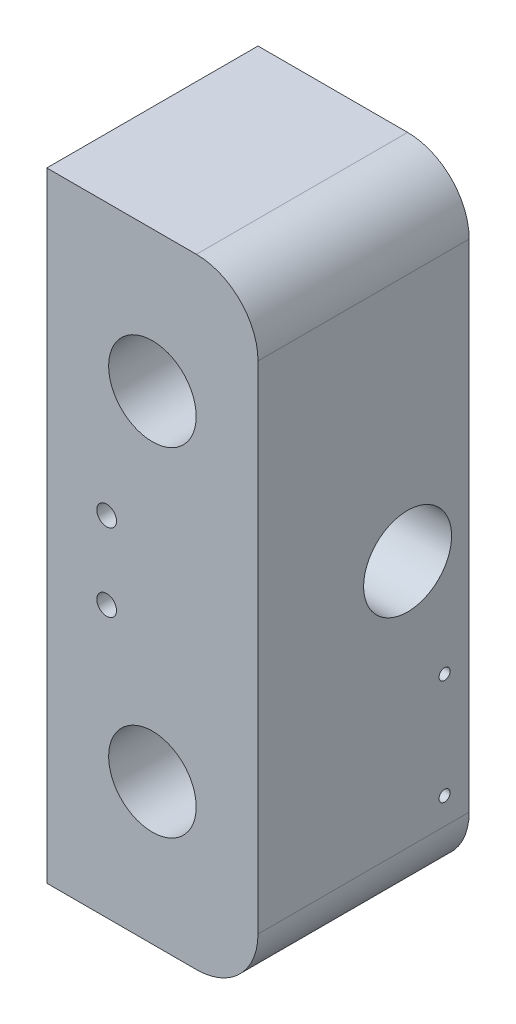
ISO-10303-21;
HEADER;
FILE_DESCRIPTION(('STEP AP214'),'2;1');
FILE_NAME('part.step','',(''),(''),'','','');
FILE_SCHEMA(('AUTOMOTIVE_DESIGN { 1 0 10303 214 1 1 1 1 }'));
ENDSEC;
DATA;
#1=APPLICATION_CONTEXT('core data for automotive mechanical design processes');
#2=APPLICATION_PROTOCOL_DEFINITION('international standard','automotive_design',2000,#1);
#3=PRODUCT_CONTEXT('',#1,'mechanical');
#4=PRODUCT('Part','Part','',(#3));
#5=PRODUCT_RELATED_PRODUCT_CATEGORY('part','',(#4));
#6=PRODUCT_DEFINITION_FORMATION('','',#4);
#7=PRODUCT_DEFINITION_CONTEXT('part definition',#1,'design');
#8=PRODUCT_DEFINITION('design','',#6,#7);
#9=PRODUCT_DEFINITION_SHAPE('','',#8);
#10=(LENGTH_UNIT() NAMED_UNIT(*) SI_UNIT(.MILLI.,.METRE.));
#11=(NAMED_UNIT(*) PLANE_ANGLE_UNIT() SI_UNIT($,.RADIAN.));
#12=(NAMED_UNIT(*) SI_UNIT($,.STERADIAN.) SOLID_ANGLE_UNIT());
#13=UNCERTAINTY_MEASURE_WITH_UNIT(LENGTH_MEASURE(1.E-05),#10,'distance_accuracy_value','');
#14=(GEOMETRIC_REPRESENTATION_CONTEXT(3) GLOBAL_UNCERTAINTY_ASSIGNED_CONTEXT((#13)) GLOBAL_UNIT_ASSIGNED_CONTEXT((#10,
#11,#12)) REPRESENTATION_CONTEXT('',''));
#15=CARTESIAN_POINT('',(0.,0.,0.));
#16=DIRECTION('',(0.,0.,1.));
#17=DIRECTION('',(1.,0.,0.));
#18=AXIS2_PLACEMENT_3D('',#15,#16,#17);
#19=CARTESIAN_POINT('',(-19.05,111.76,19.05));
#20=DIRECTION('',(0.,0.,-1.));
#21=DIRECTION('',(-1.,0.,0.));
#22=AXIS2_PLACEMENT_3D('',#19,#20,#21);
#23=PLANE('',#22);
#24=CARTESIAN_POINT('',(7.93750000000001,11.1125,19.05));
#25=DIRECTION('',(0.,0.,-1.));
#26=DIRECTION('',(-1.,0.,0.));
#27=AXIS2_PLACEMENT_3D('',#24,#25,#26);
#28=CIRCLE('',#27,11.1125);
#29=CARTESIAN_POINT('',(19.05,11.1125,19.05));
#30=VERTEX_POINT('',#29);
#31=CARTESIAN_POINT('',(7.93750000000001,0.,19.05));
#32=VERTEX_POINT('',#31);
#33=EDGE_CURVE('E213',#30,#32,#28,.T.);
#34=ORIENTED_EDGE('',*,*,#33,.F.);
#35=DIRECTION('',(0.,-1.,0.));
#36=VECTOR('',#35,1.);
#37=CARTESIAN_POINT('',(19.05,111.76,19.05));
#38=LINE('',#37,#36);
#39=CARTESIAN_POINT('',(19.05,100.6475,19.05));
#40=VERTEX_POINT('',#39);
#41=EDGE_CURVE('E177',#40,#30,#38,.T.);
#42=ORIENTED_EDGE('',*,*,#41,.F.);
#43=CARTESIAN_POINT('',(7.93750000000001,100.6475,19.05));
#44=DIRECTION('',(0.,0.,-1.));
#45=DIRECTION('',(-1.,0.,0.));
#46=AXIS2_PLACEMENT_3D('',#43,#44,#45);
#47=CIRCLE('',#46,11.1125);
#48=CARTESIAN_POINT('',(7.93750000000001,111.76,19.05));
#49=VERTEX_POINT('',#48);
#50=EDGE_CURVE('E217',#40,#49,#47,.F.);
#51=ORIENTED_EDGE('',*,*,#50,.T.);
#52=DIRECTION('',(1.,0.,0.));
#53=VECTOR('',#52,1.);
#54=CARTESIAN_POINT('',(-19.05,111.76,19.05));
#55=LINE('',#54,#53);
#56=CARTESIAN_POINT('',(-19.05,111.76,19.05));
#57=VERTEX_POINT('',#56);
#58=EDGE_CURVE('E174',#57,#49,#55,.T.);
#59=ORIENTED_EDGE('',*,*,#58,.F.);
#60=DIRECTION('',(0.,-1.,0.));
#61=VECTOR('',#60,1.);
#62=CARTESIAN_POINT('',(-19.05,111.76,19.05));
#63=LINE('',#62,#61);
#64=CARTESIAN_POINT('',(-19.05,0.,19.05));
#65=VERTEX_POINT('',#64);
#66=EDGE_CURVE('E187',#57,#65,#63,.T.);
#67=ORIENTED_EDGE('',*,*,#66,.T.);
#68=DIRECTION('',(1.,0.,0.));
#69=VECTOR('',#68,1.);
#70=CARTESIAN_POINT('',(-19.05,0.,19.05));
#71=LINE('',#70,#69);
#72=EDGE_CURVE('E172',#65,#32,#71,.T.);
#73=ORIENTED_EDGE('',*,*,#72,.T.);
#74=EDGE_LOOP('',(#34,#42,#51,#59,#67,#73));
#75=FACE_BOUND('',#74,.T.);
#76=CARTESIAN_POINT('',(-8.25500000000001,48.895,19.05));
#77=DIRECTION('',(0.,0.,-1.));
#78=DIRECTION('',(-1.,0.,0.));
#79=AXIS2_PLACEMENT_3D('',#76,#77,#78);
#80=CIRCLE('',#79,1.778);
#81=CARTESIAN_POINT('',(-10.033,48.895,19.05));
#82=VERTEX_POINT('',#81);
#83=EDGE_CURVE('E206',#82,#82,#80,.T.);
#84=ORIENTED_EDGE('',*,*,#83,.T.);
#85=EDGE_LOOP('',(#84));
#86=FACE_BOUND('',#85,.T.);
#87=CARTESIAN_POINT('',(0.,86.4,19.05));
#88=DIRECTION('',(0.,0.,-1.));
#89=DIRECTION('',(-1.,0.,0.));
#90=AXIS2_PLACEMENT_3D('',#87,#88,#89);
#91=CIRCLE('',#90,7.89999994799999);
#92=CARTESIAN_POINT('',(-7.899999948,86.4,19.05));
#93=VERTEX_POINT('',#92);
#94=EDGE_CURVE('E181',#93,#93,#91,.T.);
#95=ORIENTED_EDGE('',*,*,#94,.T.);
#96=EDGE_LOOP('',(#95));
#97=FACE_BOUND('',#96,.T.);
#98=CARTESIAN_POINT('',(0.,25.4,19.05));
#99=DIRECTION('',(0.,0.,-1.));
#100=DIRECTION('',(-1.,0.,0.));
#101=AXIS2_PLACEMENT_3D('',#98,#99,#100);
#102=CIRCLE('',#101,7.89999994800001);
#103=CARTESIAN_POINT('',(-7.89999994800001,25.4,19.05));
#104=VERTEX_POINT('',#103);
#105=EDGE_CURVE('E166',#104,#104,#102,.T.);
#106=ORIENTED_EDGE('',*,*,#105,.T.);
#107=EDGE_LOOP('',(#106));
#108=FACE_BOUND('',#107,.T.);
#109=CARTESIAN_POINT('',(-8.25500000000001,62.865,19.05));
#110=DIRECTION('',(0.,0.,-1.));
#111=DIRECTION('',(-1.,0.,0.));
#112=AXIS2_PLACEMENT_3D('',#109,#110,#111);
#113=CIRCLE('',#112,1.778);
#114=CARTESIAN_POINT('',(-10.033,62.865,19.05));
#115=VERTEX_POINT('',#114);
#116=EDGE_CURVE('E204',#115,#115,#113,.F.);
#117=ORIENTED_EDGE('',*,*,#116,.F.);
#118=EDGE_LOOP('',(#117));
#119=FACE_BOUND('',#118,.T.);
#120=ADVANCED_FACE('F34',(#75,#86,#97,#108,#119),#23,.F.);
#121=CARTESIAN_POINT('',(-19.05,111.76,-19.05));
#122=DIRECTION('',(0.,0.,1.));
#123=DIRECTION('',(1.,0.,0.));
#124=AXIS2_PLACEMENT_3D('',#121,#122,#123);
#125=PLANE('',#124);
#126=CARTESIAN_POINT('',(7.93750000000001,11.1125,-19.05));
#127=DIRECTION('',(0.,0.,-1.));
#128=DIRECTION('',(-1.,0.,0.));
#129=AXIS2_PLACEMENT_3D('',#126,#127,#128);
#130=CIRCLE('',#129,11.1125);
#131=CARTESIAN_POINT('',(19.05,11.1125,-19.05));
#132=VERTEX_POINT('',#131);
#133=CARTESIAN_POINT('',(7.93750000000001,0.,-19.05));
#134=VERTEX_POINT('',#133);
#135=EDGE_CURVE('E38',#132,#134,#130,.T.);
#136=ORIENTED_EDGE('',*,*,#135,.T.);
#137=DIRECTION('',(-1.,0.,0.));
#138=VECTOR('',#137,1.);
#139=CARTESIAN_POINT('',(-19.05,0.,-19.05));
#140=LINE('',#139,#138);
#141=CARTESIAN_POINT('',(-19.05,0.,-19.05));
#142=VERTEX_POINT('',#141);
#143=EDGE_CURVE('E178',#134,#142,#140,.T.);
#144=ORIENTED_EDGE('',*,*,#143,.T.);
#145=DIRECTION('',(0.,-1.,0.));
#146=VECTOR('',#145,1.);
#147=CARTESIAN_POINT('',(-19.05,111.76,-19.05));
#148=LINE('',#147,#146);
#149=CARTESIAN_POINT('',(-19.05,44.45,-19.05));
#150=VERTEX_POINT('',#149);
#151=EDGE_CURVE('E190',#150,#142,#148,.T.);
#152=ORIENTED_EDGE('',*,*,#151,.F.);
#153=DIRECTION('',(-1.,0.,0.));
#154=VECTOR('',#153,1.);
#155=CARTESIAN_POINT('',(-19.05,44.45,-19.05));
#156=LINE('',#155,#154);
#157=CARTESIAN_POINT('',(1.26999999999999,44.45,-19.05));
#158=VERTEX_POINT('',#157);
#159=EDGE_CURVE('E134',#158,#150,#156,.T.);
#160=ORIENTED_EDGE('',*,*,#159,.F.);
#161=DIRECTION('',(0.,-1.,0.));
#162=VECTOR('',#161,1.);
#163=CARTESIAN_POINT('',(1.26999999999999,44.45,-19.05));
#164=LINE('',#163,#162);
#165=CARTESIAN_POINT('',(1.26999999999999,67.31,-19.05));
#166=VERTEX_POINT('',#165);
#167=EDGE_CURVE('E146',#166,#158,#164,.T.);
#168=ORIENTED_EDGE('',*,*,#167,.F.);
#169=DIRECTION('',(1.,0.,0.));
#170=VECTOR('',#169,1.);
#171=CARTESIAN_POINT('',(-19.05,67.31,-19.05));
#172=LINE('',#171,#170);
#173=CARTESIAN_POINT('',(-19.05,67.31,-19.05));
#174=VERTEX_POINT('',#173);
#175=EDGE_CURVE('E153',#174,#166,#172,.T.);
#176=ORIENTED_EDGE('',*,*,#175,.F.);
#177=CARTESIAN_POINT('',(-19.05,111.76,-19.05));
#178=VERTEX_POINT('',#177);
#179=EDGE_CURVE('E44',#178,#174,#148,.T.);
#180=ORIENTED_EDGE('',*,*,#179,.F.);
#181=DIRECTION('',(-1.,0.,0.));
#182=VECTOR('',#181,1.);
#183=CARTESIAN_POINT('',(-19.05,111.76,-19.05));
#184=LINE('',#183,#182);
#185=CARTESIAN_POINT('',(7.93750000000001,111.76,-19.05));
#186=VERTEX_POINT('',#185);
#187=EDGE_CURVE('E169',#186,#178,#184,.T.);
#188=ORIENTED_EDGE('',*,*,#187,.F.);
#189=CARTESIAN_POINT('',(7.93750000000001,100.6475,-19.05));
#190=DIRECTION('',(0.,0.,-1.));
#191=DIRECTION('',(-1.,0.,0.));
#192=AXIS2_PLACEMENT_3D('',#189,#190,#191);
#193=CIRCLE('',#192,11.1125);
#194=CARTESIAN_POINT('',(19.05,100.6475,-19.05));
#195=VERTEX_POINT('',#194);
#196=EDGE_CURVE('E53',#195,#186,#193,.F.);
#197=ORIENTED_EDGE('',*,*,#196,.F.);
#198=DIRECTION('',(0.,-1.,0.));
#199=VECTOR('',#198,1.);
#200=CARTESIAN_POINT('',(19.05,111.76,-19.05));
#201=LINE('',#200,#199);
#202=EDGE_CURVE('E11',#195,#132,#201,.T.);
#203=ORIENTED_EDGE('',*,*,#202,.T.);
#204=EDGE_LOOP('',(#136,#144,#152,#160,#168,#176,#180,#188,#197,#203));
#205=FACE_BOUND('',#204,.T.);
#206=CARTESIAN_POINT('',(0.,86.4,-19.05));
#207=DIRECTION('',(0.,0.,1.));
#208=DIRECTION('',(1.,0.,0.));
#209=AXIS2_PLACEMENT_3D('',#206,#207,#208);
#210=CIRCLE('',#209,7.89999994799999);
#211=CARTESIAN_POINT('',(7.89999994799999,86.4,-19.05));
#212=VERTEX_POINT('',#211);
#213=EDGE_CURVE('E163',#212,#212,#210,.T.);
#214=ORIENTED_EDGE('',*,*,#213,.T.);
#215=EDGE_LOOP('',(#214));
#216=FACE_BOUND('',#215,.T.);
#217=CARTESIAN_POINT('',(0.,25.4,-19.05));
#218=DIRECTION('',(0.,0.,1.));
#219=DIRECTION('',(1.,0.,0.));
#220=AXIS2_PLACEMENT_3D('',#217,#218,#219);
#221=CIRCLE('',#220,7.89999994800001);
#222=CARTESIAN_POINT('',(7.89999994800001,25.4,-19.05));
#223=VERTEX_POINT('',#222);
#224=EDGE_CURVE('E138',#223,#223,#221,.T.);
#225=ORIENTED_EDGE('',*,*,#224,.T.);
#226=EDGE_LOOP('',(#225));
#227=FACE_BOUND('',#226,.T.);
#228=ADVANCED_FACE('F262',(#205,#216,#227),#125,.F.);
#229=CARTESIAN_POINT('',(0.,111.76,0.));
#230=DIRECTION('',(0.,-1.,0.));
#231=DIRECTION('',(0.,0.,-1.));
#232=AXIS2_PLACEMENT_3D('',#229,#230,#231);
#233=PLANE('',#232);
#234=DIRECTION('',(0.,0.,-1.));
#235=VECTOR('',#234,1.);
#236=CARTESIAN_POINT('',(7.93750000000001,111.76,19.05));
#237=LINE('',#236,#235);
#238=EDGE_CURVE('E76',#49,#186,#237,.T.);
#239=ORIENTED_EDGE('',*,*,#238,.T.);
#240=ORIENTED_EDGE('',*,*,#187,.T.);
#241=DIRECTION('',(0.,0.,1.));
#242=VECTOR('',#241,1.);
#243=CARTESIAN_POINT('',(-19.05,111.76,19.05));
#244=LINE('',#243,#242);
#245=EDGE_CURVE('E171',#178,#57,#244,.T.);
#246=ORIENTED_EDGE('',*,*,#245,.T.);
#247=ORIENTED_EDGE('',*,*,#58,.T.);
#248=EDGE_LOOP('',(#239,#240,#246,#247));
#249=FACE_BOUND('',#248,.T.);
#250=ADVANCED_FACE('F268',(#249),#233,.F.);
#251=CARTESIAN_POINT('',(0.,0.,3.17499999999999));
#252=DIRECTION('',(0.,0.,1.));
#253=DIRECTION('',(1.,0.,0.));
#254=AXIS2_PLACEMENT_3D('',#251,#252,#253);
#255=PLANE('',#254);
#256=CARTESIAN_POINT('',(-8.25500000000001,48.895,3.17499999999999));
#257=DIRECTION('',(0.,0.,1.));
#258=DIRECTION('',(1.,0.,0.));
#259=AXIS2_PLACEMENT_3D('',#256,#257,#258);
#260=CIRCLE('',#259,1.778);
#261=CARTESIAN_POINT('',(-6.47700000000001,48.895,3.17499999999999));
#262=VERTEX_POINT('',#261);
#263=EDGE_CURVE('E200',#262,#262,#260,.T.);
#264=ORIENTED_EDGE('',*,*,#263,.T.);
#265=EDGE_LOOP('',(#264));
#266=FACE_BOUND('',#265,.T.);
#267=DIRECTION('',(0.,1.,0.));
#268=VECTOR('',#267,1.);
#269=CARTESIAN_POINT('',(-19.05,67.31,3.17499999999999));
#270=LINE('',#269,#268);
#271=CARTESIAN_POINT('',(-19.05,44.45,3.17499999999999));
#272=VERTEX_POINT('',#271);
#273=CARTESIAN_POINT('',(-19.05,67.31,3.17499999999999));
#274=VERTEX_POINT('',#273);
#275=EDGE_CURVE('E123',#272,#274,#270,.T.);
#276=ORIENTED_EDGE('',*,*,#275,.T.);
#277=DIRECTION('',(1.,0.,0.));
#278=VECTOR('',#277,1.);
#279=CARTESIAN_POINT('',(-19.05,67.31,3.17499999999999));
#280=LINE('',#279,#278);
#281=CARTESIAN_POINT('',(1.26999999999999,67.31,3.17499999999999));
#282=VERTEX_POINT('',#281);
#283=EDGE_CURVE('E143',#274,#282,#280,.T.);
#284=ORIENTED_EDGE('',*,*,#283,.T.);
#285=DIRECTION('',(0.,-1.,0.));
#286=VECTOR('',#285,1.);
#287=CARTESIAN_POINT('',(1.26999999999999,44.45,3.17499999999999));
#288=LINE('',#287,#286);
#289=CARTESIAN_POINT('',(1.26999999999999,44.45,3.17499999999999));
#290=VERTEX_POINT('',#289);
#291=EDGE_CURVE('E126',#282,#290,#288,.T.);
#292=ORIENTED_EDGE('',*,*,#291,.T.);
#293=DIRECTION('',(-1.,0.,0.));
#294=VECTOR('',#293,1.);
#295=CARTESIAN_POINT('',(-19.05,44.45,3.17499999999999));
#296=LINE('',#295,#294);
#297=EDGE_CURVE('E117',#290,#272,#296,.T.);
#298=ORIENTED_EDGE('',*,*,#297,.T.);
#299=EDGE_LOOP('',(#276,#284,#292,#298));
#300=FACE_BOUND('',#299,.T.);
#301=CARTESIAN_POINT('',(-8.25500000000001,62.865,3.17499999999999));
#302=DIRECTION('',(0.,0.,1.));
#303=DIRECTION('',(1.,0.,0.));
#304=AXIS2_PLACEMENT_3D('',#301,#302,#303);
#305=CIRCLE('',#304,1.778);
#306=CARTESIAN_POINT('',(-6.47700000000001,62.865,3.17499999999999));
#307=VERTEX_POINT('',#306);
#308=EDGE_CURVE('E203',#307,#307,#305,.F.);
#309=ORIENTED_EDGE('',*,*,#308,.F.);
#310=EDGE_LOOP('',(#309));
#311=FACE_BOUND('',#310,.T.);
#312=ADVANCED_FACE('F119',(#266,#300,#311),#255,.F.);
#313=CARTESIAN_POINT('',(19.05,111.76,19.05));
#314=DIRECTION('',(-1.,0.,0.));
#315=DIRECTION('',(0.,0.,1.));
#316=AXIS2_PLACEMENT_3D('',#313,#314,#315);
#317=PLANE('',#316);
#318=CARTESIAN_POINT('',(19.05,55.88,-7.93750000000001));
#319=DIRECTION('',(-1.,0.,0.));
#320=DIRECTION('',(0.,0.,1.));
#321=AXIS2_PLACEMENT_3D('',#318,#319,#320);
#322=CIRCLE('',#321,7.9375);
#323=CARTESIAN_POINT('',(19.05,55.88,0.));
#324=VERTEX_POINT('',#323);
#325=EDGE_CURVE('E199',#324,#324,#322,.T.);
#326=ORIENTED_EDGE('',*,*,#325,.T.);
#327=EDGE_LOOP('',(#326));
#328=FACE_BOUND('',#327,.T.);
#329=CARTESIAN_POINT('',(19.05,15.9,-14.605));
#330=DIRECTION('',(1.,0.,0.));
#331=DIRECTION('',(0.,0.,-1.));
#332=AXIS2_PLACEMENT_3D('',#329,#330,#331);
#333=CIRCLE('',#332,1.);
#334=CARTESIAN_POINT('',(19.05,15.9,-15.605));
#335=VERTEX_POINT('',#334);
#336=EDGE_CURVE('E149',#335,#335,#333,.T.);
#337=ORIENTED_EDGE('',*,*,#336,.F.);
#338=EDGE_LOOP('',(#337));
#339=FACE_BOUND('',#338,.T.);
#340=ORIENTED_EDGE('',*,*,#41,.T.);
#341=DIRECTION('',(0.,0.,-1.));
#342=VECTOR('',#341,1.);
#343=CARTESIAN_POINT('',(19.05,11.1125,19.05));
#344=LINE('',#343,#342);
#345=EDGE_CURVE('E211',#30,#132,#344,.T.);
#346=ORIENTED_EDGE('',*,*,#345,.T.);
#347=ORIENTED_EDGE('',*,*,#202,.F.);
#348=DIRECTION('',(0.,0.,-1.));
#349=VECTOR('',#348,1.);
#350=CARTESIAN_POINT('',(19.05,100.6475,19.05));
#351=LINE('',#350,#349);
#352=EDGE_CURVE('E219',#40,#195,#351,.T.);
#353=ORIENTED_EDGE('',*,*,#352,.F.);
#354=EDGE_LOOP('',(#340,#346,#347,#353));
#355=FACE_BOUND('',#354,.T.);
#356=CARTESIAN_POINT('',(19.05,34.9,-14.605));
#357=DIRECTION('',(1.,0.,0.));
#358=DIRECTION('',(0.,0.,-1.));
#359=AXIS2_PLACEMENT_3D('',#356,#357,#358);
#360=CIRCLE('',#359,1.);
#361=CARTESIAN_POINT('',(19.05,34.9,-15.605));
#362=VERTEX_POINT('',#361);
#363=EDGE_CURVE('E228',#362,#362,#360,.F.);
#364=ORIENTED_EDGE('',*,*,#363,.T.);
#365=EDGE_LOOP('',(#364));
#366=FACE_BOUND('',#365,.T.);
#367=ADVANCED_FACE('F36',(#328,#339,#355,#366),#317,.F.);
#368=CARTESIAN_POINT('',(-19.05,111.76,19.05));
#369=DIRECTION('',(1.,0.,0.));
#370=DIRECTION('',(0.,0.,-1.));
#371=AXIS2_PLACEMENT_3D('',#368,#369,#370);
#372=PLANE('',#371);
#373=ORIENTED_EDGE('',*,*,#275,.F.);
#374=DIRECTION('',(0.,0.,-1.));
#375=VECTOR('',#374,1.);
#376=CARTESIAN_POINT('',(-19.05,44.45,3.17499999999999));
#377=LINE('',#376,#375);
#378=EDGE_CURVE('E131',#272,#150,#377,.T.);
#379=ORIENTED_EDGE('',*,*,#378,.T.);
#380=ORIENTED_EDGE('',*,*,#151,.T.);
#381=DIRECTION('',(0.,0.,1.));
#382=VECTOR('',#381,1.);
#383=CARTESIAN_POINT('',(-19.05,0.,19.05));
#384=LINE('',#383,#382);
#385=EDGE_CURVE('E180',#142,#65,#384,.T.);
#386=ORIENTED_EDGE('',*,*,#385,.T.);
#387=ORIENTED_EDGE('',*,*,#66,.F.);
#388=ORIENTED_EDGE('',*,*,#245,.F.);
#389=ORIENTED_EDGE('',*,*,#179,.T.);
#390=DIRECTION('',(0.,0.,-1.));
#391=VECTOR('',#390,1.);
#392=CARTESIAN_POINT('',(-19.05,67.31,3.17499999999999));
#393=LINE('',#392,#391);
#394=EDGE_CURVE('E128',#274,#174,#393,.T.);
#395=ORIENTED_EDGE('',*,*,#394,.F.);
#396=EDGE_LOOP('',(#373,#379,#380,#386,#387,#388,#389,#395));
#397=FACE_BOUND('',#396,.T.);
#398=ADVANCED_FACE('F141',(#397),#372,.F.);
#399=CARTESIAN_POINT('',(0.,0.,0.));
#400=DIRECTION('',(0.,-1.,0.));
#401=DIRECTION('',(0.,0.,-1.));
#402=AXIS2_PLACEMENT_3D('',#399,#400,#401);
#403=PLANE('',#402);
#404=DIRECTION('',(0.,0.,-1.));
#405=VECTOR('',#404,1.);
#406=CARTESIAN_POINT('',(7.93750000000001,0.,19.05));
#407=LINE('',#406,#405);
#408=EDGE_CURVE('E72',#32,#134,#407,.T.);
#409=ORIENTED_EDGE('',*,*,#408,.F.);
#410=ORIENTED_EDGE('',*,*,#72,.F.);
#411=ORIENTED_EDGE('',*,*,#385,.F.);
#412=ORIENTED_EDGE('',*,*,#143,.F.);
#413=EDGE_LOOP('',(#409,#410,#411,#412));
#414=FACE_BOUND('',#413,.T.);
#415=ADVANCED_FACE('F273',(#414),#403,.T.);
#416=CARTESIAN_POINT('',(0.,25.4,-19.05));
#417=DIRECTION('',(0.,0.,1.));
#418=DIRECTION('',(1.,0.,0.));
#419=AXIS2_PLACEMENT_3D('',#416,#417,#418);
#420=CYLINDRICAL_SURFACE('',#419,7.89999994800001);
#421=ORIENTED_EDGE('',*,*,#224,.F.);
#422=EDGE_LOOP('',(#421));
#423=FACE_BOUND('',#422,.T.);
#424=ORIENTED_EDGE('',*,*,#105,.F.);
#425=EDGE_LOOP('',(#424));
#426=FACE_BOUND('',#425,.T.);
#427=ADVANCED_FACE('F279',(#423,#426),#420,.F.);
#428=CARTESIAN_POINT('',(0.,86.4,-19.05));
#429=DIRECTION('',(0.,0.,1.));
#430=DIRECTION('',(1.,0.,0.));
#431=AXIS2_PLACEMENT_3D('',#428,#429,#430);
#432=CYLINDRICAL_SURFACE('',#431,7.89999994799999);
#433=ORIENTED_EDGE('',*,*,#213,.F.);
#434=EDGE_LOOP('',(#433));
#435=FACE_BOUND('',#434,.T.);
#436=ORIENTED_EDGE('',*,*,#94,.F.);
#437=EDGE_LOOP('',(#436));
#438=FACE_BOUND('',#437,.T.);
#439=ADVANCED_FACE('F284',(#435,#438),#432,.F.);
#440=CARTESIAN_POINT('',(-19.05,44.45,3.17499999999999));
#441=DIRECTION('',(0.,-1.,0.));
#442=DIRECTION('',(0.,0.,-1.));
#443=AXIS2_PLACEMENT_3D('',#440,#441,#442);
#444=PLANE('',#443);
#445=ORIENTED_EDGE('',*,*,#159,.T.);
#446=ORIENTED_EDGE('',*,*,#378,.F.);
#447=ORIENTED_EDGE('',*,*,#297,.F.);
#448=DIRECTION('',(0.,0.,-1.));
#449=VECTOR('',#448,1.);
#450=CARTESIAN_POINT('',(1.26999999999999,44.45,3.17499999999999));
#451=LINE('',#450,#449);
#452=EDGE_CURVE('E139',#290,#158,#451,.T.);
#453=ORIENTED_EDGE('',*,*,#452,.T.);
#454=EDGE_LOOP('',(#445,#446,#447,#453));
#455=FACE_BOUND('',#454,.T.);
#456=ADVANCED_FACE('F132',(#455),#444,.F.);
#457=CARTESIAN_POINT('',(1.26999999999999,44.45,3.17499999999999));
#458=DIRECTION('',(1.,0.,0.));
#459=DIRECTION('',(0.,0.,-1.));
#460=AXIS2_PLACEMENT_3D('',#457,#458,#459);
#461=PLANE('',#460);
#462=CARTESIAN_POINT('',(1.26999999999999,55.88,-7.93750000000001));
#463=DIRECTION('',(1.,0.,0.));
#464=DIRECTION('',(0.,0.,-1.));
#465=AXIS2_PLACEMENT_3D('',#462,#463,#464);
#466=CIRCLE('',#465,7.9375);
#467=CARTESIAN_POINT('',(1.26999999999999,55.88,-15.875));
#468=VERTEX_POINT('',#467);
#469=EDGE_CURVE('E196',#468,#468,#466,.T.);
#470=ORIENTED_EDGE('',*,*,#469,.T.);
#471=EDGE_LOOP('',(#470));
#472=FACE_BOUND('',#471,.T.);
#473=ORIENTED_EDGE('',*,*,#167,.T.);
#474=ORIENTED_EDGE('',*,*,#452,.F.);
#475=ORIENTED_EDGE('',*,*,#291,.F.);
#476=DIRECTION('',(0.,0.,-1.));
#477=VECTOR('',#476,1.);
#478=CARTESIAN_POINT('',(1.26999999999999,67.31,3.17499999999999));
#479=LINE('',#478,#477);
#480=EDGE_CURVE('E160',#282,#166,#479,.T.);
#481=ORIENTED_EDGE('',*,*,#480,.T.);
#482=EDGE_LOOP('',(#473,#474,#475,#481));
#483=FACE_BOUND('',#482,.T.);
#484=ADVANCED_FACE('F297',(#472,#483),#461,.F.);
#485=CARTESIAN_POINT('',(-19.05,67.31,3.17499999999999));
#486=DIRECTION('',(0.,1.,0.));
#487=DIRECTION('',(0.,0.,1.));
#488=AXIS2_PLACEMENT_3D('',#485,#486,#487);
#489=PLANE('',#488);
#490=ORIENTED_EDGE('',*,*,#175,.T.);
#491=ORIENTED_EDGE('',*,*,#480,.F.);
#492=ORIENTED_EDGE('',*,*,#283,.F.);
#493=ORIENTED_EDGE('',*,*,#394,.T.);
#494=EDGE_LOOP('',(#490,#491,#492,#493));
#495=FACE_BOUND('',#494,.T.);
#496=ADVANCED_FACE('F299',(#495),#489,.F.);
#497=CARTESIAN_POINT('',(13.335,15.9,-14.605));
#498=DIRECTION('',(1.,0.,0.));
#499=DIRECTION('',(0.,0.,-1.));
#500=AXIS2_PLACEMENT_3D('',#497,#498,#499);
#501=CYLINDRICAL_SURFACE('',#500,1.);
#502=CARTESIAN_POINT('',(13.335,15.9,-14.605));
#503=DIRECTION('',(1.,0.,0.));
#504=DIRECTION('',(0.,0.,-1.));
#505=AXIS2_PLACEMENT_3D('',#502,#503,#504);
#506=CIRCLE('',#505,1.);
#507=CARTESIAN_POINT('',(13.335,15.9,-15.605));
#508=VERTEX_POINT('',#507);
#509=EDGE_CURVE('E230',#508,#508,#506,.T.);
#510=ORIENTED_EDGE('',*,*,#509,.F.);
#511=EDGE_LOOP('',(#510));
#512=FACE_BOUND('',#511,.T.);
#513=ORIENTED_EDGE('',*,*,#336,.T.);
#514=EDGE_LOOP('',(#513));
#515=FACE_BOUND('',#514,.T.);
#516=ADVANCED_FACE('F237',(#512,#515),#501,.F.);
#517=CARTESIAN_POINT('',(13.335,0.,0.));
#518=DIRECTION('',(1.,0.,0.));
#519=DIRECTION('',(0.,0.,-1.));
#520=AXIS2_PLACEMENT_3D('',#517,#518,#519);
#521=PLANE('',#520);
#522=ORIENTED_EDGE('',*,*,#509,.T.);
#523=EDGE_LOOP('',(#522));
#524=FACE_BOUND('',#523,.T.);
#525=ADVANCED_FACE('F250',(#524),#521,.T.);
#526=CARTESIAN_POINT('',(13.335,34.9,-14.605));
#527=DIRECTION('',(1.,0.,0.));
#528=DIRECTION('',(0.,0.,-1.));
#529=AXIS2_PLACEMENT_3D('',#526,#527,#528);
#530=CYLINDRICAL_SURFACE('',#529,1.);
#531=CARTESIAN_POINT('',(13.335,34.9,-14.605));
#532=DIRECTION('',(1.,0.,0.));
#533=DIRECTION('',(0.,0.,-1.));
#534=AXIS2_PLACEMENT_3D('',#531,#532,#533);
#535=CIRCLE('',#534,1.);
#536=CARTESIAN_POINT('',(13.335,34.9,-15.605));
#537=VERTEX_POINT('',#536);
#538=EDGE_CURVE('E156',#537,#537,#535,.F.);
#539=ORIENTED_EDGE('',*,*,#538,.T.);
#540=EDGE_LOOP('',(#539));
#541=FACE_BOUND('',#540,.T.);
#542=ORIENTED_EDGE('',*,*,#363,.F.);
#543=EDGE_LOOP('',(#542));
#544=FACE_BOUND('',#543,.T.);
#545=ADVANCED_FACE('F247',(#541,#544),#530,.F.);
#546=CARTESIAN_POINT('',(13.335,0.,0.));
#547=DIRECTION('',(1.,0.,0.));
#548=DIRECTION('',(0.,0.,-1.));
#549=AXIS2_PLACEMENT_3D('',#546,#547,#548);
#550=PLANE('',#549);
#551=ORIENTED_EDGE('',*,*,#538,.F.);
#552=EDGE_LOOP('',(#551));
#553=FACE_BOUND('',#552,.T.);
#554=ADVANCED_FACE('F249',(#553),#550,.T.);
#555=CARTESIAN_POINT('',(19.05,55.88,-7.93750000000001));
#556=DIRECTION('',(-1.,0.,0.));
#557=DIRECTION('',(0.,0.,1.));
#558=AXIS2_PLACEMENT_3D('',#555,#556,#557);
#559=CYLINDRICAL_SURFACE('',#558,7.9375);
#560=ORIENTED_EDGE('',*,*,#325,.F.);
#561=EDGE_LOOP('',(#560));
#562=FACE_BOUND('',#561,.T.);
#563=ORIENTED_EDGE('',*,*,#469,.F.);
#564=EDGE_LOOP('',(#563));
#565=FACE_BOUND('',#564,.T.);
#566=ADVANCED_FACE('F257',(#562,#565),#559,.F.);
#567=CARTESIAN_POINT('',(-8.25500000000001,48.895,19.05));
#568=DIRECTION('',(0.,0.,-1.));
#569=DIRECTION('',(-1.,0.,0.));
#570=AXIS2_PLACEMENT_3D('',#567,#568,#569);
#571=CYLINDRICAL_SURFACE('',#570,1.778);
#572=ORIENTED_EDGE('',*,*,#83,.F.);
#573=EDGE_LOOP('',(#572));
#574=FACE_BOUND('',#573,.T.);
#575=ORIENTED_EDGE('',*,*,#263,.F.);
#576=EDGE_LOOP('',(#575));
#577=FACE_BOUND('',#576,.T.);
#578=ADVANCED_FACE('F333',(#574,#577),#571,.F.);
#579=CARTESIAN_POINT('',(-8.25500000000001,62.865,19.05));
#580=DIRECTION('',(0.,0.,-1.));
#581=DIRECTION('',(-1.,0.,0.));
#582=AXIS2_PLACEMENT_3D('',#579,#580,#581);
#583=CYLINDRICAL_SURFACE('',#582,1.778);
#584=ORIENTED_EDGE('',*,*,#116,.T.);
#585=EDGE_LOOP('',(#584));
#586=FACE_BOUND('',#585,.T.);
#587=ORIENTED_EDGE('',*,*,#308,.T.);
#588=EDGE_LOOP('',(#587));
#589=FACE_BOUND('',#588,.T.);
#590=ADVANCED_FACE('F326',(#586,#589),#583,.F.);
#591=CARTESIAN_POINT('',(7.93750000000001,11.1125,19.05));
#592=DIRECTION('',(0.,0.,-1.));
#593=DIRECTION('',(-1.,0.,0.));
#594=AXIS2_PLACEMENT_3D('',#591,#592,#593);
#595=CYLINDRICAL_SURFACE('',#594,11.1125);
#596=ORIENTED_EDGE('',*,*,#135,.F.);
#597=ORIENTED_EDGE('',*,*,#345,.F.);
#598=ORIENTED_EDGE('',*,*,#33,.T.);
#599=ORIENTED_EDGE('',*,*,#408,.T.);
#600=EDGE_LOOP('',(#596,#597,#598,#599));
#601=FACE_BOUND('',#600,.T.);
#602=ADVANCED_FACE('F323',(#601),#595,.T.);
#603=CARTESIAN_POINT('',(7.93750000000001,100.6475,19.05));
#604=DIRECTION('',(0.,0.,-1.));
#605=DIRECTION('',(-1.,0.,0.));
#606=AXIS2_PLACEMENT_3D('',#603,#604,#605);
#607=CYLINDRICAL_SURFACE('',#606,11.1125);
#608=ORIENTED_EDGE('',*,*,#238,.F.);
#609=ORIENTED_EDGE('',*,*,#50,.F.);
#610=ORIENTED_EDGE('',*,*,#352,.T.);
#611=ORIENTED_EDGE('',*,*,#196,.T.);
#612=EDGE_LOOP('',(#608,#609,#610,#611));
#613=FACE_BOUND('',#612,.T.);
#614=ADVANCED_FACE('F325',(#613),#607,.T.);
#615=CLOSED_SHELL('',(#120,#228,#250,#312,#367,#398,#415,#427,#439,#456,#484,#496,#516,#525,
#545,#554,#566,#578,#590,#602,#614));
#616=MANIFOLD_SOLID_BREP('B2',#615);
#617=ADVANCED_BREP_SHAPE_REPRESENTATION('',(#18,#616),#14);
#618=SHAPE_DEFINITION_REPRESENTATION(#9,#617);
ENDSEC;
END-ISO-10303-21;
